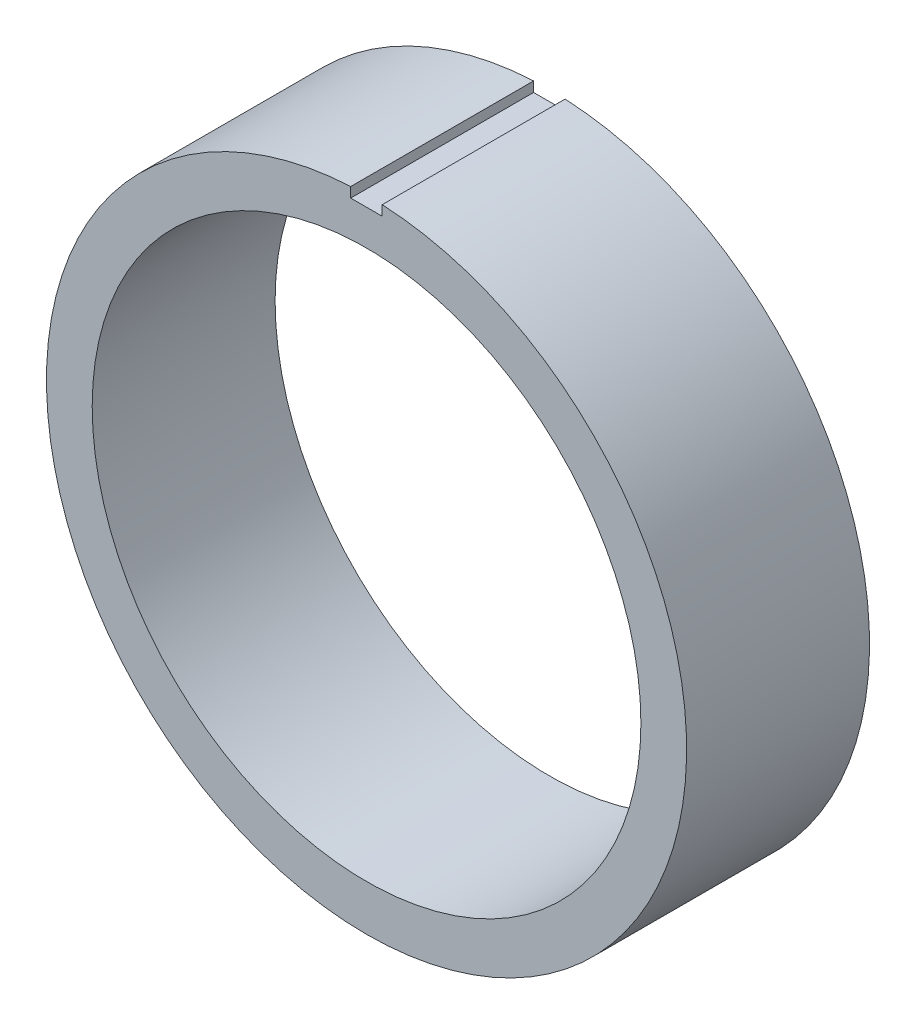
ISO-10303-21;
HEADER;
FILE_DESCRIPTION(('STEP AP214'),'2;1');
FILE_NAME('part.step','',(''),(''),'','','');
FILE_SCHEMA(('AUTOMOTIVE_DESIGN { 1 0 10303 214 1 1 1 1 }'));
ENDSEC;
DATA;
#1=APPLICATION_CONTEXT('core data for automotive mechanical design processes');
#2=APPLICATION_PROTOCOL_DEFINITION('international standard','automotive_design',2000,#1);
#3=PRODUCT_CONTEXT('',#1,'mechanical');
#4=PRODUCT('Part','Part','',(#3));
#5=PRODUCT_RELATED_PRODUCT_CATEGORY('part','',(#4));
#6=PRODUCT_DEFINITION_FORMATION('','',#4);
#7=PRODUCT_DEFINITION_CONTEXT('part definition',#1,'design');
#8=PRODUCT_DEFINITION('design','',#6,#7);
#9=PRODUCT_DEFINITION_SHAPE('','',#8);
#10=(LENGTH_UNIT() NAMED_UNIT(*) SI_UNIT(.MILLI.,.METRE.));
#11=(NAMED_UNIT(*) PLANE_ANGLE_UNIT() SI_UNIT($,.RADIAN.));
#12=(NAMED_UNIT(*) SI_UNIT($,.STERADIAN.) SOLID_ANGLE_UNIT());
#13=UNCERTAINTY_MEASURE_WITH_UNIT(LENGTH_MEASURE(1.E-05),#10,'distance_accuracy_value','');
#14=(GEOMETRIC_REPRESENTATION_CONTEXT(3) GLOBAL_UNCERTAINTY_ASSIGNED_CONTEXT((#13)) GLOBAL_UNIT_ASSIGNED_CONTEXT((#10,
#11,#12)) REPRESENTATION_CONTEXT('',''));
#15=CARTESIAN_POINT('',(0.,0.,0.));
#16=DIRECTION('',(0.,0.,1.));
#17=DIRECTION('',(1.,0.,0.));
#18=AXIS2_PLACEMENT_3D('',#15,#16,#17);
#19=CARTESIAN_POINT('',(0.,0.,8.));
#20=DIRECTION('',(0.,0.,1.));
#21=DIRECTION('',(1.,0.,0.));
#22=AXIS2_PLACEMENT_3D('',#19,#20,#21);
#23=PLANE('',#22);
#24=DIRECTION('',(0.,-1.,0.));
#25=VECTOR('',#24,1.);
#26=CARTESIAN_POINT('',(-0.692678904616998,14.3623233004855,8.));
#27=LINE('',#26,#25);
#28=CARTESIAN_POINT('',(-0.692678904616998,13.9828536406235,8.));
#29=VERTEX_POINT('',#28);
#30=CARTESIAN_POINT('',(-0.692678904616998,13.5447512074465,8.));
#31=VERTEX_POINT('',#30);
#32=EDGE_CURVE('E85',#29,#31,#27,.T.);
#33=ORIENTED_EDGE('',*,*,#32,.F.);
#34=CARTESIAN_POINT('',(0.,0.,8.));
#35=DIRECTION('',(0.,0.,1.));
#36=DIRECTION('',(1.,0.,0.));
#37=AXIS2_PLACEMENT_3D('',#34,#35,#36);
#38=CIRCLE('',#37,14.);
#39=CARTESIAN_POINT('',(0.684284620501432,13.9832669486835,8.));
#40=VERTEX_POINT('',#39);
#41=EDGE_CURVE('E107',#29,#40,#38,.T.);
#42=ORIENTED_EDGE('',*,*,#41,.T.);
#43=DIRECTION('',(0.,1.,0.));
#44=VECTOR('',#43,1.);
#45=CARTESIAN_POINT('',(0.684284620501432,14.3623233004855,8.));
#46=LINE('',#45,#44);
#47=CARTESIAN_POINT('',(0.684284620501432,13.5447512074465,8.));
#48=VERTEX_POINT('',#47);
#49=EDGE_CURVE('E50',#48,#40,#46,.T.);
#50=ORIENTED_EDGE('',*,*,#49,.F.);
#51=DIRECTION('',(1.,0.,0.));
#52=VECTOR('',#51,1.);
#53=CARTESIAN_POINT('',(-0.692678904616998,13.5447512074465,8.));
#54=LINE('',#53,#52);
#55=EDGE_CURVE('E81',#31,#48,#54,.T.);
#56=ORIENTED_EDGE('',*,*,#55,.F.);
#57=EDGE_LOOP('',(#33,#42,#50,#56));
#58=FACE_BOUND('',#57,.T.);
#59=CARTESIAN_POINT('',(0.,0.,8.));
#60=DIRECTION('',(0.,0.,1.));
#61=DIRECTION('',(1.,0.,0.));
#62=AXIS2_PLACEMENT_3D('',#59,#60,#61);
#63=CIRCLE('',#62,12.);
#64=CARTESIAN_POINT('',(12.,0.,8.));
#65=VERTEX_POINT('',#64);
#66=EDGE_CURVE('E101',#65,#65,#63,.T.);
#67=ORIENTED_EDGE('',*,*,#66,.F.);
#68=EDGE_LOOP('',(#67));
#69=FACE_BOUND('',#68,.T.);
#70=ADVANCED_FACE('F35',(#58,#69),#23,.T.);
#71=CARTESIAN_POINT('',(0.,0.,0.));
#72=DIRECTION('',(0.,0.,1.));
#73=DIRECTION('',(1.,0.,0.));
#74=AXIS2_PLACEMENT_3D('',#71,#72,#73);
#75=PLANE('',#74);
#76=CARTESIAN_POINT('',(0.,0.,0.));
#77=DIRECTION('',(0.,0.,1.));
#78=DIRECTION('',(1.,0.,0.));
#79=AXIS2_PLACEMENT_3D('',#76,#77,#78);
#80=CIRCLE('',#79,14.);
#81=CARTESIAN_POINT('',(-0.692678904616998,13.9828536406235,0.));
#82=VERTEX_POINT('',#81);
#83=CARTESIAN_POINT('',(0.684284620501432,13.9832669486835,0.));
#84=VERTEX_POINT('',#83);
#85=EDGE_CURVE('E104',#82,#84,#80,.T.);
#86=ORIENTED_EDGE('',*,*,#85,.F.);
#87=DIRECTION('',(0.,-1.,0.));
#88=VECTOR('',#87,1.);
#89=CARTESIAN_POINT('',(-0.692678904616998,0.,0.));
#90=LINE('',#89,#88);
#91=CARTESIAN_POINT('',(-0.692678904616998,13.5447512074465,0.));
#92=VERTEX_POINT('',#91);
#93=EDGE_CURVE('E58',#82,#92,#90,.T.);
#94=ORIENTED_EDGE('',*,*,#93,.T.);
#95=DIRECTION('',(1.,0.,0.));
#96=VECTOR('',#95,1.);
#97=CARTESIAN_POINT('',(0.,13.5447512074465,0.));
#98=LINE('',#97,#96);
#99=CARTESIAN_POINT('',(0.684284620501432,13.5447512074465,0.));
#100=VERTEX_POINT('',#99);
#101=EDGE_CURVE('E11',#92,#100,#98,.T.);
#102=ORIENTED_EDGE('',*,*,#101,.T.);
#103=DIRECTION('',(0.,1.,0.));
#104=VECTOR('',#103,1.);
#105=CARTESIAN_POINT('',(0.684284620501432,0.,0.));
#106=LINE('',#105,#104);
#107=EDGE_CURVE('E95',#100,#84,#106,.T.);
#108=ORIENTED_EDGE('',*,*,#107,.T.);
#109=EDGE_LOOP('',(#86,#94,#102,#108));
#110=FACE_BOUND('',#109,.T.);
#111=CARTESIAN_POINT('',(0.,0.,0.));
#112=DIRECTION('',(0.,0.,1.));
#113=DIRECTION('',(1.,0.,0.));
#114=AXIS2_PLACEMENT_3D('',#111,#112,#113);
#115=CIRCLE('',#114,12.);
#116=CARTESIAN_POINT('',(12.,0.,0.));
#117=VERTEX_POINT('',#116);
#118=EDGE_CURVE('E100',#117,#117,#115,.T.);
#119=ORIENTED_EDGE('',*,*,#118,.T.);
#120=EDGE_LOOP('',(#119));
#121=FACE_BOUND('',#120,.T.);
#122=ADVANCED_FACE('F115',(#110,#121),#75,.F.);
#123=CARTESIAN_POINT('',(0.,0.,8.));
#124=DIRECTION('',(0.,0.,-1.));
#125=DIRECTION('',(-1.,0.,0.));
#126=AXIS2_PLACEMENT_3D('',#123,#124,#125);
#127=CYLINDRICAL_SURFACE('',#126,14.);
#128=ORIENTED_EDGE('',*,*,#41,.F.);
#129=DIRECTION('',(0.,0.,-1.));
#130=VECTOR('',#129,1.);
#131=CARTESIAN_POINT('',(-0.692678904616998,13.9828536406235,8.));
#132=LINE('',#131,#130);
#133=EDGE_CURVE('E43',#29,#82,#132,.T.);
#134=ORIENTED_EDGE('',*,*,#133,.T.);
#135=ORIENTED_EDGE('',*,*,#85,.T.);
#136=DIRECTION('',(0.,0.,-1.));
#137=VECTOR('',#136,1.);
#138=CARTESIAN_POINT('',(0.684284620501432,13.9832669486835,8.));
#139=LINE('',#138,#137);
#140=EDGE_CURVE('E109',#84,#40,#139,.F.);
#141=ORIENTED_EDGE('',*,*,#140,.T.);
#142=EDGE_LOOP('',(#128,#134,#135,#141));
#143=FACE_BOUND('',#142,.T.);
#144=ADVANCED_FACE('F37',(#143),#127,.T.);
#145=CARTESIAN_POINT('',(0.,0.,8.));
#146=DIRECTION('',(0.,0.,-1.));
#147=DIRECTION('',(-1.,0.,0.));
#148=AXIS2_PLACEMENT_3D('',#145,#146,#147);
#149=CYLINDRICAL_SURFACE('',#148,12.);
#150=ORIENTED_EDGE('',*,*,#66,.T.);
#151=EDGE_LOOP('',(#150));
#152=FACE_BOUND('',#151,.T.);
#153=ORIENTED_EDGE('',*,*,#118,.F.);
#154=EDGE_LOOP('',(#153));
#155=FACE_BOUND('',#154,.T.);
#156=ADVANCED_FACE('F131',(#152,#155),#149,.F.);
#157=CARTESIAN_POINT('',(-0.692678904616998,13.5447512074465,-2.));
#158=DIRECTION('',(0.,-1.,0.));
#159=DIRECTION('',(0.,0.,-1.));
#160=AXIS2_PLACEMENT_3D('',#157,#158,#159);
#161=PLANE('',#160);
#162=DIRECTION('',(0.,0.,1.));
#163=VECTOR('',#162,1.);
#164=CARTESIAN_POINT('',(-0.692678904616998,13.5447512074465,-2.));
#165=LINE('',#164,#163);
#166=EDGE_CURVE('E76',#92,#31,#165,.T.);
#167=ORIENTED_EDGE('',*,*,#166,.T.);
#168=ORIENTED_EDGE('',*,*,#55,.T.);
#169=DIRECTION('',(0.,0.,1.));
#170=VECTOR('',#169,1.);
#171=CARTESIAN_POINT('',(0.684284620501432,13.5447512074465,-2.));
#172=LINE('',#171,#170);
#173=EDGE_CURVE('E82',#100,#48,#172,.T.);
#174=ORIENTED_EDGE('',*,*,#173,.F.);
#175=ORIENTED_EDGE('',*,*,#101,.F.);
#176=EDGE_LOOP('',(#167,#168,#174,#175));
#177=FACE_BOUND('',#176,.T.);
#178=ADVANCED_FACE('F78',(#177),#161,.F.);
#179=CARTESIAN_POINT('',(-0.692678904616998,14.3623233004855,-2.));
#180=DIRECTION('',(-1.,0.,0.));
#181=DIRECTION('',(0.,0.,1.));
#182=AXIS2_PLACEMENT_3D('',#179,#180,#181);
#183=PLANE('',#182);
#184=ORIENTED_EDGE('',*,*,#133,.F.);
#185=ORIENTED_EDGE('',*,*,#32,.T.);
#186=ORIENTED_EDGE('',*,*,#166,.F.);
#187=ORIENTED_EDGE('',*,*,#93,.F.);
#188=EDGE_LOOP('',(#184,#185,#186,#187));
#189=FACE_BOUND('',#188,.T.);
#190=ADVANCED_FACE('F86',(#189),#183,.F.);
#191=CARTESIAN_POINT('',(0.684284620501432,14.3623233004855,-2.));
#192=DIRECTION('',(1.,0.,0.));
#193=DIRECTION('',(0.,0.,-1.));
#194=AXIS2_PLACEMENT_3D('',#191,#192,#193);
#195=PLANE('',#194);
#196=ORIENTED_EDGE('',*,*,#173,.T.);
#197=ORIENTED_EDGE('',*,*,#49,.T.);
#198=ORIENTED_EDGE('',*,*,#140,.F.);
#199=ORIENTED_EDGE('',*,*,#107,.F.);
#200=EDGE_LOOP('',(#196,#197,#198,#199));
#201=FACE_BOUND('',#200,.T.);
#202=ADVANCED_FACE('F117',(#201),#195,.F.);
#203=CLOSED_SHELL('',(#70,#122,#144,#156,#178,#190,#202));
#204=MANIFOLD_SOLID_BREP('B2',#203);
#205=ADVANCED_BREP_SHAPE_REPRESENTATION('',(#18,#204),#14);
#206=SHAPE_DEFINITION_REPRESENTATION(#9,#205);
ENDSEC;
END-ISO-10303-21;
